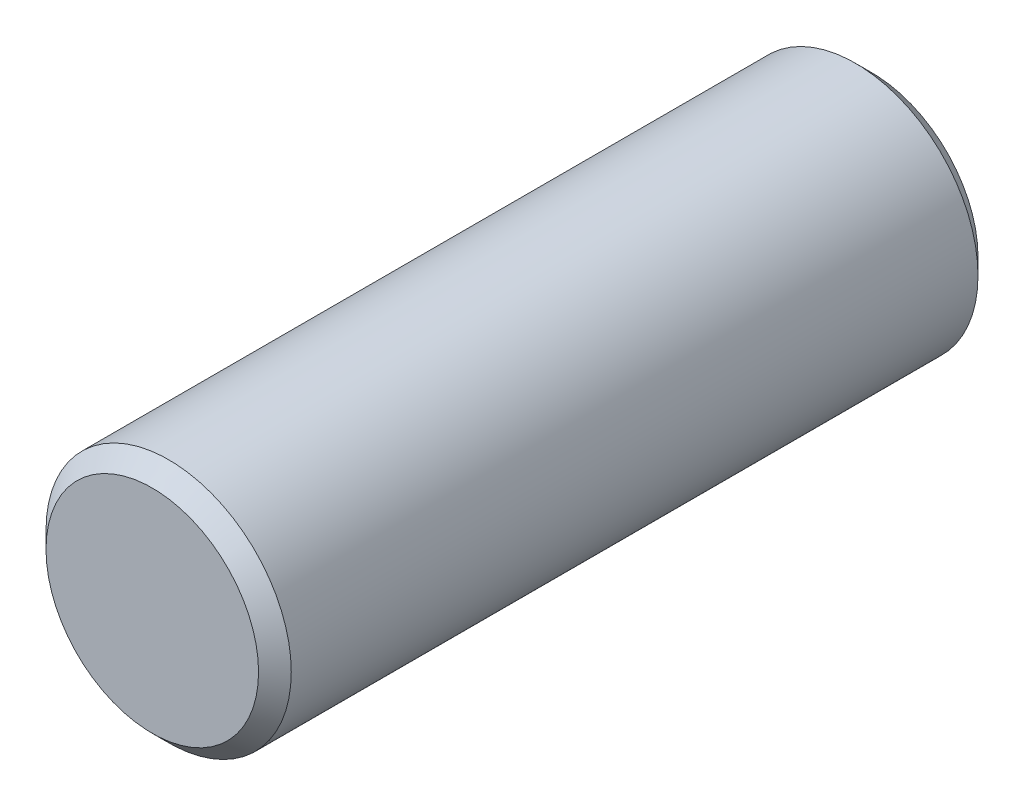
ISO-10303-21;
HEADER;
FILE_DESCRIPTION(('STEP AP214'),'2;1');
FILE_NAME('part.step','',(''),(''),'','','');
FILE_SCHEMA(('AUTOMOTIVE_DESIGN { 1 0 10303 214 1 1 1 1 }'));
ENDSEC;
DATA;
#1=APPLICATION_CONTEXT('core data for automotive mechanical design processes');
#2=APPLICATION_PROTOCOL_DEFINITION('international standard','automotive_design',2000,#1);
#3=PRODUCT_CONTEXT('',#1,'mechanical');
#4=PRODUCT('Part','Part','',(#3));
#5=PRODUCT_RELATED_PRODUCT_CATEGORY('part','',(#4));
#6=PRODUCT_DEFINITION_FORMATION('','',#4);
#7=PRODUCT_DEFINITION_CONTEXT('part definition',#1,'design');
#8=PRODUCT_DEFINITION('design','',#6,#7);
#9=PRODUCT_DEFINITION_SHAPE('','',#8);
#10=(LENGTH_UNIT() NAMED_UNIT(*) SI_UNIT(.MILLI.,.METRE.));
#11=(NAMED_UNIT(*) PLANE_ANGLE_UNIT() SI_UNIT($,.RADIAN.));
#12=(NAMED_UNIT(*) SI_UNIT($,.STERADIAN.) SOLID_ANGLE_UNIT());
#13=UNCERTAINTY_MEASURE_WITH_UNIT(LENGTH_MEASURE(1.E-05),#10,'distance_accuracy_value','');
#14=(GEOMETRIC_REPRESENTATION_CONTEXT(3) GLOBAL_UNCERTAINTY_ASSIGNED_CONTEXT((#13)) GLOBAL_UNIT_ASSIGNED_CONTEXT((#10,
#11,#12)) REPRESENTATION_CONTEXT('',''));
#15=CARTESIAN_POINT('',(0.,0.,0.));
#16=DIRECTION('',(0.,0.,1.));
#17=DIRECTION('',(1.,0.,0.));
#18=AXIS2_PLACEMENT_3D('',#15,#16,#17);
#19=CARTESIAN_POINT('',(0.,0.,44.));
#20=DIRECTION('',(0.,0.,-1.));
#21=DIRECTION('',(-1.,0.,0.));
#22=AXIS2_PLACEMENT_3D('',#19,#20,#21);
#23=CYLINDRICAL_SURFACE('',#22,7.5);
#24=CARTESIAN_POINT('',(0.,0.,43.));
#25=DIRECTION('',(0.,0.,1.));
#26=DIRECTION('',(1.,0.,0.));
#27=AXIS2_PLACEMENT_3D('',#24,#25,#26);
#28=CIRCLE('',#27,7.5);
#29=CARTESIAN_POINT('',(7.5,0.,43.));
#30=VERTEX_POINT('',#29);
#31=EDGE_CURVE('E10',#30,#30,#28,.F.);
#32=ORIENTED_EDGE('',*,*,#31,.T.);
#33=EDGE_LOOP('',(#32));
#34=FACE_BOUND('',#33,.T.);
#35=CARTESIAN_POINT('',(0.,0.,1.00000000000001));
#36=DIRECTION('',(0.,0.,1.));
#37=DIRECTION('',(1.,0.,0.));
#38=AXIS2_PLACEMENT_3D('',#35,#36,#37);
#39=CIRCLE('',#38,7.5);
#40=CARTESIAN_POINT('',(7.5,0.,1.00000000000001));
#41=VERTEX_POINT('',#40);
#42=EDGE_CURVE('E55',#41,#41,#39,.T.);
#43=ORIENTED_EDGE('',*,*,#42,.T.);
#44=EDGE_LOOP('',(#43));
#45=FACE_BOUND('',#44,.T.);
#46=ADVANCED_FACE('F37',(#34,#45),#23,.T.);
#47=CARTESIAN_POINT('',(0.,0.,44.));
#48=DIRECTION('',(0.,0.,1.));
#49=DIRECTION('',(1.,0.,0.));
#50=AXIS2_PLACEMENT_3D('',#47,#48,#49);
#51=PLANE('',#50);
#52=CARTESIAN_POINT('',(0.,0.,44.));
#53=DIRECTION('',(0.,0.,1.));
#54=DIRECTION('',(1.,0.,0.));
#55=AXIS2_PLACEMENT_3D('',#52,#53,#54);
#56=CIRCLE('',#55,6.50000000000001);
#57=CARTESIAN_POINT('',(6.50000000000001,0.,44.));
#58=VERTEX_POINT('',#57);
#59=EDGE_CURVE('E45',#58,#58,#56,.T.);
#60=ORIENTED_EDGE('',*,*,#59,.T.);
#61=EDGE_LOOP('',(#60));
#62=FACE_BOUND('',#61,.T.);
#63=ADVANCED_FACE('F72',(#62),#51,.T.);
#64=CARTESIAN_POINT('',(0.,0.,0.));
#65=DIRECTION('',(0.,0.,1.));
#66=DIRECTION('',(1.,0.,0.));
#67=AXIS2_PLACEMENT_3D('',#64,#65,#66);
#68=PLANE('',#67);
#69=CARTESIAN_POINT('',(0.,0.,0.));
#70=DIRECTION('',(0.,0.,1.));
#71=DIRECTION('',(1.,0.,0.));
#72=AXIS2_PLACEMENT_3D('',#69,#70,#71);
#73=CIRCLE('',#72,6.49999999999998);
#74=CARTESIAN_POINT('',(6.49999999999998,0.,0.));
#75=VERTEX_POINT('',#74);
#76=EDGE_CURVE('E50',#75,#75,#73,.F.);
#77=ORIENTED_EDGE('',*,*,#76,.T.);
#78=EDGE_LOOP('',(#77));
#79=FACE_BOUND('',#78,.T.);
#80=ADVANCED_FACE('F65',(#79),#68,.F.);
#81=CARTESIAN_POINT('',(0.,0.,1.00000000000001));
#82=DIRECTION('',(0.,0.,1.));
#83=DIRECTION('',(1.,0.,0.));
#84=AXIS2_PLACEMENT_3D('',#81,#82,#83);
#85=CONICAL_SURFACE('',#84,7.5,0.785398163397451);
#86=ORIENTED_EDGE('',*,*,#76,.F.);
#87=EDGE_LOOP('',(#86));
#88=FACE_BOUND('',#87,.T.);
#89=ORIENTED_EDGE('',*,*,#42,.F.);
#90=EDGE_LOOP('',(#89));
#91=FACE_BOUND('',#90,.T.);
#92=ADVANCED_FACE('F63',(#88,#91),#85,.T.);
#93=CARTESIAN_POINT('',(0.,0.,44.));
#94=DIRECTION('',(0.,0.,-1.));
#95=DIRECTION('',(-1.,0.,0.));
#96=AXIS2_PLACEMENT_3D('',#93,#94,#95);
#97=CONICAL_SURFACE('',#96,6.50000000000001,0.785398163397442);
#98=ORIENTED_EDGE('',*,*,#31,.F.);
#99=EDGE_LOOP('',(#98));
#100=FACE_BOUND('',#99,.T.);
#101=ORIENTED_EDGE('',*,*,#59,.F.);
#102=EDGE_LOOP('',(#101));
#103=FACE_BOUND('',#102,.T.);
#104=ADVANCED_FACE('F39',(#100,#103),#97,.T.);
#105=CLOSED_SHELL('',(#46,#63,#80,#92,#104));
#106=MANIFOLD_SOLID_BREP('B2',#105);
#107=ADVANCED_BREP_SHAPE_REPRESENTATION('',(#18,#106),#14);
#108=SHAPE_DEFINITION_REPRESENTATION(#9,#107);
ENDSEC;
END-ISO-10303-21;
